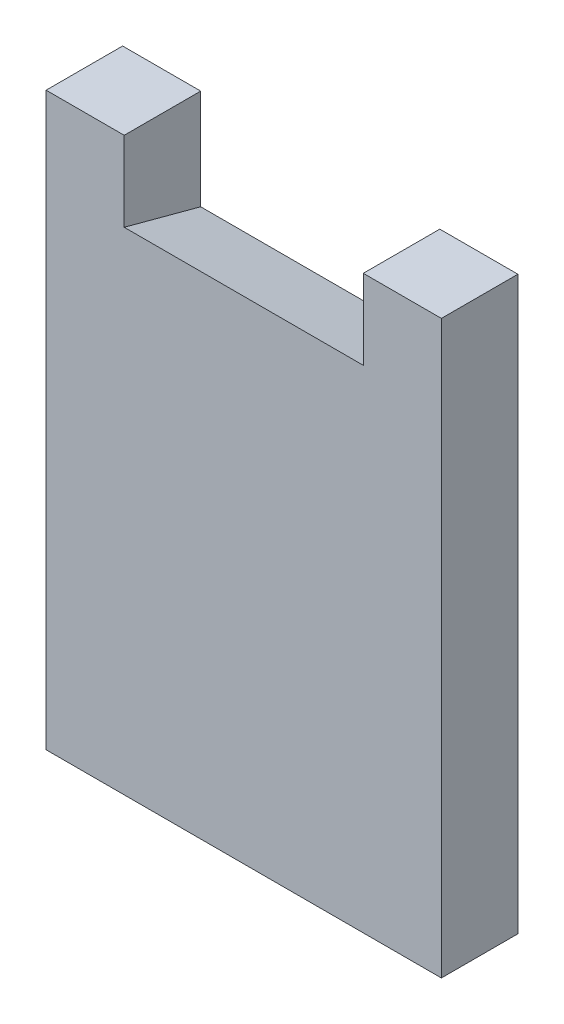
ISO-10303-21;
HEADER;
FILE_DESCRIPTION(('STEP AP214'),'2;1');
FILE_NAME('part.step','',(''),(''),'','','');
FILE_SCHEMA(('AUTOMOTIVE_DESIGN { 1 0 10303 214 1 1 1 1 }'));
ENDSEC;
DATA;
#1=APPLICATION_CONTEXT('core data for automotive mechanical design processes');
#2=APPLICATION_PROTOCOL_DEFINITION('international standard','automotive_design',2000,#1);
#3=PRODUCT_CONTEXT('',#1,'mechanical');
#4=PRODUCT('Part','Part','',(#3));
#5=PRODUCT_RELATED_PRODUCT_CATEGORY('part','',(#4));
#6=PRODUCT_DEFINITION_FORMATION('','',#4);
#7=PRODUCT_DEFINITION_CONTEXT('part definition',#1,'design');
#8=PRODUCT_DEFINITION('design','',#6,#7);
#9=PRODUCT_DEFINITION_SHAPE('','',#8);
#10=(LENGTH_UNIT() NAMED_UNIT(*) SI_UNIT(.MILLI.,.METRE.));
#11=(NAMED_UNIT(*) PLANE_ANGLE_UNIT() SI_UNIT($,.RADIAN.));
#12=(NAMED_UNIT(*) SI_UNIT($,.STERADIAN.) SOLID_ANGLE_UNIT());
#13=UNCERTAINTY_MEASURE_WITH_UNIT(LENGTH_MEASURE(1.E-05),#10,'distance_accuracy_value','');
#14=(GEOMETRIC_REPRESENTATION_CONTEXT(3) GLOBAL_UNCERTAINTY_ASSIGNED_CONTEXT((#13)) GLOBAL_UNIT_ASSIGNED_CONTEXT((#10,
#11,#12)) REPRESENTATION_CONTEXT('',''));
#15=CARTESIAN_POINT('',(0.,0.,0.));
#16=DIRECTION('',(0.,0.,1.));
#17=DIRECTION('',(1.,0.,0.));
#18=AXIS2_PLACEMENT_3D('',#15,#16,#17);
#19=CARTESIAN_POINT('',(0.,0.,9.6));
#20=DIRECTION('',(0.,1.,0.));
#21=DIRECTION('',(0.,0.,1.));
#22=AXIS2_PLACEMENT_3D('',#19,#20,#21);
#23=PLANE('',#22);
#24=DIRECTION('',(1.,0.,0.));
#25=VECTOR('',#24,1.);
#26=CARTESIAN_POINT('',(0.,0.,0.));
#27=LINE('',#26,#25);
#28=CARTESIAN_POINT('',(39.8,0.,0.));
#29=VERTEX_POINT('',#28);
#30=CARTESIAN_POINT('',(49.6,0.,0.));
#31=VERTEX_POINT('',#30);
#32=EDGE_CURVE('E116',#29,#31,#27,.T.);
#33=ORIENTED_EDGE('',*,*,#32,.F.);
#34=DIRECTION('',(0.,0.,-1.));
#35=VECTOR('',#34,1.);
#36=CARTESIAN_POINT('',(39.8,0.,9.6));
#37=LINE('',#36,#35);
#38=CARTESIAN_POINT('',(39.8,0.,9.6));
#39=VERTEX_POINT('',#38);
#40=EDGE_CURVE('E11',#39,#29,#37,.T.);
#41=ORIENTED_EDGE('',*,*,#40,.F.);
#42=DIRECTION('',(1.,0.,0.));
#43=VECTOR('',#42,1.);
#44=CARTESIAN_POINT('',(0.,0.,9.6));
#45=LINE('',#44,#43);
#46=CARTESIAN_POINT('',(49.6,0.,9.6));
#47=VERTEX_POINT('',#46);
#48=EDGE_CURVE('E126',#39,#47,#45,.T.);
#49=ORIENTED_EDGE('',*,*,#48,.T.);
#50=DIRECTION('',(0.,0.,-1.));
#51=VECTOR('',#50,1.);
#52=CARTESIAN_POINT('',(49.6,0.,9.6));
#53=LINE('',#52,#51);
#54=EDGE_CURVE('E57',#47,#31,#53,.T.);
#55=ORIENTED_EDGE('',*,*,#54,.T.);
#56=EDGE_LOOP('',(#33,#41,#49,#55));
#57=FACE_BOUND('',#56,.T.);
#58=ADVANCED_FACE('F38',(#57),#23,.T.);
#59=CARTESIAN_POINT('',(39.8,0.,9.6));
#60=DIRECTION('',(1.,0.,0.));
#61=DIRECTION('',(0.,0.,-1.));
#62=AXIS2_PLACEMENT_3D('',#59,#60,#61);
#63=PLANE('',#62);
#64=DIRECTION('',(0.,-1.,0.));
#65=VECTOR('',#64,1.);
#66=CARTESIAN_POINT('',(39.8,0.,0.));
#67=LINE('',#66,#65);
#68=CARTESIAN_POINT('',(39.8,-12.5723122473388,0.));
#69=VERTEX_POINT('',#68);
#70=EDGE_CURVE('E106',#29,#69,#67,.T.);
#71=ORIENTED_EDGE('',*,*,#70,.T.);
#72=DIRECTION('',(0.,-0.258819045102521,-0.965925826289068));
#73=VECTOR('',#72,1.);
#74=CARTESIAN_POINT('',(39.8,-9.99999999999999,9.6));
#75=LINE('',#74,#73);
#76=CARTESIAN_POINT('',(39.8,-9.99999999999999,9.6));
#77=VERTEX_POINT('',#76);
#78=EDGE_CURVE('E48',#77,#69,#75,.T.);
#79=ORIENTED_EDGE('',*,*,#78,.F.);
#80=DIRECTION('',(0.,-1.,0.));
#81=VECTOR('',#80,1.);
#82=CARTESIAN_POINT('',(39.8,0.,9.6));
#83=LINE('',#82,#81);
#84=EDGE_CURVE('E154',#39,#77,#83,.T.);
#85=ORIENTED_EDGE('',*,*,#84,.F.);
#86=ORIENTED_EDGE('',*,*,#40,.T.);
#87=EDGE_LOOP('',(#71,#79,#85,#86));
#88=FACE_BOUND('',#87,.T.);
#89=ADVANCED_FACE('F163',(#88),#63,.F.);
#90=CARTESIAN_POINT('',(0.,-10.,9.6));
#91=DIRECTION('',(0.,0.965925826289068,-0.258819045102521));
#92=DIRECTION('',(0.,0.258819045102521,0.965925826289068));
#93=AXIS2_PLACEMENT_3D('',#90,#91,#92);
#94=PLANE('',#93);
#95=DIRECTION('',(1.,0.,0.));
#96=VECTOR('',#95,1.);
#97=CARTESIAN_POINT('',(0.,-12.5723122473388,0.));
#98=LINE('',#97,#96);
#99=CARTESIAN_POINT('',(9.79999999999999,-12.5723122473388,0.));
#100=VERTEX_POINT('',#99);
#101=EDGE_CURVE('E103',#100,#69,#98,.T.);
#102=ORIENTED_EDGE('',*,*,#101,.F.);
#103=DIRECTION('',(0.,-0.258819045102521,-0.965925826289068));
#104=VECTOR('',#103,1.);
#105=CARTESIAN_POINT('',(9.79999999999999,-10.,9.6));
#106=LINE('',#105,#104);
#107=CARTESIAN_POINT('',(9.79999999999999,-10.,9.6));
#108=VERTEX_POINT('',#107);
#109=EDGE_CURVE('E42',#108,#100,#106,.T.);
#110=ORIENTED_EDGE('',*,*,#109,.F.);
#111=DIRECTION('',(1.,0.,0.));
#112=VECTOR('',#111,1.);
#113=CARTESIAN_POINT('',(0.,-10.,9.6));
#114=LINE('',#113,#112);
#115=EDGE_CURVE('E150',#108,#77,#114,.T.);
#116=ORIENTED_EDGE('',*,*,#115,.T.);
#117=ORIENTED_EDGE('',*,*,#78,.T.);
#118=EDGE_LOOP('',(#102,#110,#116,#117));
#119=FACE_BOUND('',#118,.T.);
#120=ADVANCED_FACE('F40',(#119),#94,.T.);
#121=CARTESIAN_POINT('',(9.8,0.,9.6));
#122=DIRECTION('',(1.,0.,0.));
#123=DIRECTION('',(0.,1.,0.));
#124=AXIS2_PLACEMENT_3D('',#121,#122,#123);
#125=PLANE('',#124);
#126=DIRECTION('',(0.,-1.,0.));
#127=VECTOR('',#126,1.);
#128=CARTESIAN_POINT('',(9.8,0.,0.));
#129=LINE('',#128,#127);
#130=CARTESIAN_POINT('',(9.8,0.,0.));
#131=VERTEX_POINT('',#130);
#132=EDGE_CURVE('E95',#131,#100,#129,.T.);
#133=ORIENTED_EDGE('',*,*,#132,.F.);
#134=DIRECTION('',(0.,0.,-1.));
#135=VECTOR('',#134,1.);
#136=CARTESIAN_POINT('',(9.8,0.,9.6));
#137=LINE('',#136,#135);
#138=CARTESIAN_POINT('',(9.8,0.,9.6));
#139=VERTEX_POINT('',#138);
#140=EDGE_CURVE('E101',#139,#131,#137,.T.);
#141=ORIENTED_EDGE('',*,*,#140,.F.);
#142=DIRECTION('',(0.,-1.,0.));
#143=VECTOR('',#142,1.);
#144=CARTESIAN_POINT('',(9.8,0.,9.6));
#145=LINE('',#144,#143);
#146=EDGE_CURVE('E99',#139,#108,#145,.T.);
#147=ORIENTED_EDGE('',*,*,#146,.T.);
#148=ORIENTED_EDGE('',*,*,#109,.T.);
#149=EDGE_LOOP('',(#133,#141,#147,#148));
#150=FACE_BOUND('',#149,.T.);
#151=ADVANCED_FACE('F92',(#150),#125,.T.);
#152=CARTESIAN_POINT('',(0.,0.,0.));
#153=VERTEX_POINT('',#152);
#154=EDGE_CURVE('E112',#153,#131,#27,.T.);
#155=ORIENTED_EDGE('',*,*,#154,.F.);
#156=DIRECTION('',(0.,0.,-1.));
#157=VECTOR('',#156,1.);
#158=CARTESIAN_POINT('',(0.,0.,9.6));
#159=LINE('',#158,#157);
#160=CARTESIAN_POINT('',(0.,0.,9.6));
#161=VERTEX_POINT('',#160);
#162=EDGE_CURVE('E134',#161,#153,#159,.T.);
#163=ORIENTED_EDGE('',*,*,#162,.F.);
#164=EDGE_CURVE('E142',#161,#139,#45,.T.);
#165=ORIENTED_EDGE('',*,*,#164,.T.);
#166=ORIENTED_EDGE('',*,*,#140,.T.);
#167=EDGE_LOOP('',(#155,#163,#165,#166));
#168=FACE_BOUND('',#167,.T.);
#169=ADVANCED_FACE('F138',(#168),#23,.T.);
#170=CARTESIAN_POINT('',(0.,0.,9.6));
#171=DIRECTION('',(1.,0.,0.));
#172=DIRECTION('',(0.,1.,0.));
#173=AXIS2_PLACEMENT_3D('',#170,#171,#172);
#174=PLANE('',#173);
#175=DIRECTION('',(0.,-1.,0.));
#176=VECTOR('',#175,1.);
#177=CARTESIAN_POINT('',(0.,0.,0.));
#178=LINE('',#177,#176);
#179=CARTESIAN_POINT('',(0.,-71.68,0.));
#180=VERTEX_POINT('',#179);
#181=EDGE_CURVE('E114',#153,#180,#178,.T.);
#182=ORIENTED_EDGE('',*,*,#181,.T.);
#183=DIRECTION('',(0.,0.,-1.));
#184=VECTOR('',#183,1.);
#185=CARTESIAN_POINT('',(0.,-71.68,9.6));
#186=LINE('',#185,#184);
#187=CARTESIAN_POINT('',(0.,-71.68,9.6));
#188=VERTEX_POINT('',#187);
#189=EDGE_CURVE('E131',#188,#180,#186,.T.);
#190=ORIENTED_EDGE('',*,*,#189,.F.);
#191=DIRECTION('',(0.,-1.,0.));
#192=VECTOR('',#191,1.);
#193=CARTESIAN_POINT('',(0.,0.,9.6));
#194=LINE('',#193,#192);
#195=EDGE_CURVE('E152',#161,#188,#194,.T.);
#196=ORIENTED_EDGE('',*,*,#195,.F.);
#197=ORIENTED_EDGE('',*,*,#162,.T.);
#198=EDGE_LOOP('',(#182,#190,#196,#197));
#199=FACE_BOUND('',#198,.T.);
#200=ADVANCED_FACE('F177',(#199),#174,.F.);
#201=CARTESIAN_POINT('',(0.,-71.68,9.6));
#202=DIRECTION('',(0.,1.,0.));
#203=DIRECTION('',(-1.,0.,0.));
#204=AXIS2_PLACEMENT_3D('',#201,#202,#203);
#205=PLANE('',#204);
#206=DIRECTION('',(1.,0.,0.));
#207=VECTOR('',#206,1.);
#208=CARTESIAN_POINT('',(0.,-71.68,0.));
#209=LINE('',#208,#207);
#210=CARTESIAN_POINT('',(49.6,-71.68,0.));
#211=VERTEX_POINT('',#210);
#212=EDGE_CURVE('E120',#180,#211,#209,.T.);
#213=ORIENTED_EDGE('',*,*,#212,.T.);
#214=DIRECTION('',(0.,0.,-1.));
#215=VECTOR('',#214,1.);
#216=CARTESIAN_POINT('',(49.6,-71.68,9.6));
#217=LINE('',#216,#215);
#218=CARTESIAN_POINT('',(49.6,-71.68,9.6));
#219=VERTEX_POINT('',#218);
#220=EDGE_CURVE('E128',#219,#211,#217,.T.);
#221=ORIENTED_EDGE('',*,*,#220,.F.);
#222=DIRECTION('',(1.,0.,0.));
#223=VECTOR('',#222,1.);
#224=CARTESIAN_POINT('',(0.,-71.68,9.6));
#225=LINE('',#224,#223);
#226=EDGE_CURVE('E159',#188,#219,#225,.T.);
#227=ORIENTED_EDGE('',*,*,#226,.F.);
#228=ORIENTED_EDGE('',*,*,#189,.T.);
#229=EDGE_LOOP('',(#213,#221,#227,#228));
#230=FACE_BOUND('',#229,.T.);
#231=ADVANCED_FACE('F174',(#230),#205,.F.);
#232=CARTESIAN_POINT('',(49.6,0.,9.6));
#233=DIRECTION('',(1.,0.,0.));
#234=DIRECTION('',(0.,1.,0.));
#235=AXIS2_PLACEMENT_3D('',#232,#233,#234);
#236=PLANE('',#235);
#237=DIRECTION('',(0.,-1.,0.));
#238=VECTOR('',#237,1.);
#239=CARTESIAN_POINT('',(49.6,0.,0.));
#240=LINE('',#239,#238);
#241=EDGE_CURVE('E123',#31,#211,#240,.T.);
#242=ORIENTED_EDGE('',*,*,#241,.F.);
#243=ORIENTED_EDGE('',*,*,#54,.F.);
#244=DIRECTION('',(0.,-1.,0.));
#245=VECTOR('',#244,1.);
#246=CARTESIAN_POINT('',(49.6,0.,9.6));
#247=LINE('',#246,#245);
#248=EDGE_CURVE('E129',#47,#219,#247,.T.);
#249=ORIENTED_EDGE('',*,*,#248,.T.);
#250=ORIENTED_EDGE('',*,*,#220,.T.);
#251=EDGE_LOOP('',(#242,#243,#249,#250));
#252=FACE_BOUND('',#251,.T.);
#253=ADVANCED_FACE('F171',(#252),#236,.T.);
#254=CARTESIAN_POINT('',(0.,0.,9.6));
#255=DIRECTION('',(0.,0.,1.));
#256=DIRECTION('',(1.,0.,0.));
#257=AXIS2_PLACEMENT_3D('',#254,#255,#256);
#258=PLANE('',#257);
#259=ORIENTED_EDGE('',*,*,#48,.F.);
#260=ORIENTED_EDGE('',*,*,#84,.T.);
#261=ORIENTED_EDGE('',*,*,#115,.F.);
#262=ORIENTED_EDGE('',*,*,#146,.F.);
#263=ORIENTED_EDGE('',*,*,#164,.F.);
#264=ORIENTED_EDGE('',*,*,#195,.T.);
#265=ORIENTED_EDGE('',*,*,#226,.T.);
#266=ORIENTED_EDGE('',*,*,#248,.F.);
#267=EDGE_LOOP('',(#259,#260,#261,#262,#263,#264,#265,#266));
#268=FACE_BOUND('',#267,.T.);
#269=ADVANCED_FACE('F147',(#268),#258,.T.);
#270=CARTESIAN_POINT('',(0.,0.,0.));
#271=DIRECTION('',(0.,0.,1.));
#272=DIRECTION('',(1.,0.,0.));
#273=AXIS2_PLACEMENT_3D('',#270,#271,#272);
#274=PLANE('',#273);
#275=ORIENTED_EDGE('',*,*,#32,.T.);
#276=ORIENTED_EDGE('',*,*,#241,.T.);
#277=ORIENTED_EDGE('',*,*,#212,.F.);
#278=ORIENTED_EDGE('',*,*,#181,.F.);
#279=ORIENTED_EDGE('',*,*,#154,.T.);
#280=ORIENTED_EDGE('',*,*,#132,.T.);
#281=ORIENTED_EDGE('',*,*,#101,.T.);
#282=ORIENTED_EDGE('',*,*,#70,.F.);
#283=EDGE_LOOP('',(#275,#276,#277,#278,#279,#280,#281,#282));
#284=FACE_BOUND('',#283,.T.);
#285=ADVANCED_FACE('F109',(#284),#274,.F.);
#286=CLOSED_SHELL('',(#58,#89,#120,#151,#169,#200,#231,#253,#269,#285));
#287=MANIFOLD_SOLID_BREP('B2',#286);
#288=ADVANCED_BREP_SHAPE_REPRESENTATION('',(#18,#287),#14);
#289=SHAPE_DEFINITION_REPRESENTATION(#9,#288);
ENDSEC;
END-ISO-10303-21;
